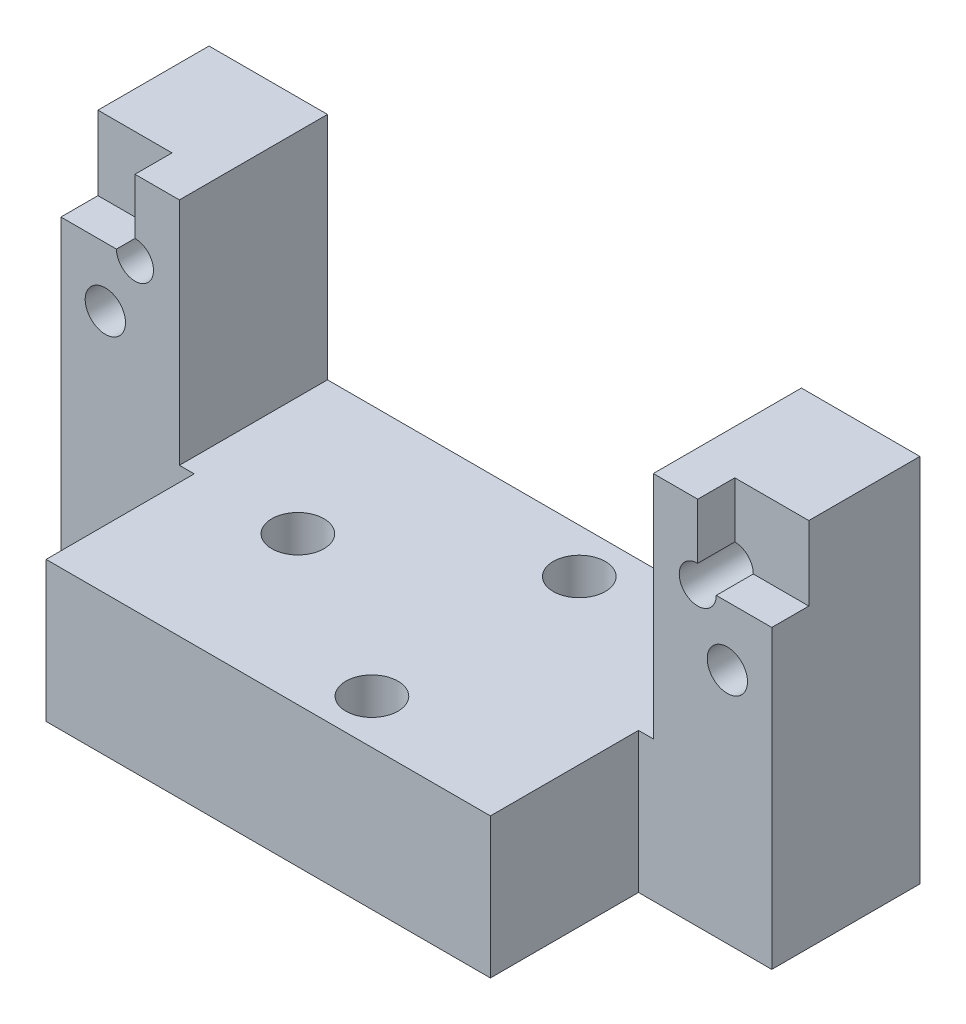
ISO-10303-21;
HEADER;
FILE_DESCRIPTION(('STEP AP214'),'2;1');
FILE_NAME('part.step','',(''),(''),'','','');
FILE_SCHEMA(('AUTOMOTIVE_DESIGN { 1 0 10303 214 1 1 1 1 }'));
ENDSEC;
DATA;
#1=APPLICATION_CONTEXT('core data for automotive mechanical design processes');
#2=APPLICATION_PROTOCOL_DEFINITION('international standard','automotive_design',2000,#1);
#3=PRODUCT_CONTEXT('',#1,'mechanical');
#4=PRODUCT('Part','Part','',(#3));
#5=PRODUCT_RELATED_PRODUCT_CATEGORY('part','',(#4));
#6=PRODUCT_DEFINITION_FORMATION('','',#4);
#7=PRODUCT_DEFINITION_CONTEXT('part definition',#1,'design');
#8=PRODUCT_DEFINITION('design','',#6,#7);
#9=PRODUCT_DEFINITION_SHAPE('','',#8);
#10=(LENGTH_UNIT() NAMED_UNIT(*) SI_UNIT(.MILLI.,.METRE.));
#11=(NAMED_UNIT(*) PLANE_ANGLE_UNIT() SI_UNIT($,.RADIAN.));
#12=(NAMED_UNIT(*) SI_UNIT($,.STERADIAN.) SOLID_ANGLE_UNIT());
#13=UNCERTAINTY_MEASURE_WITH_UNIT(LENGTH_MEASURE(1.E-05),#10,'distance_accuracy_value','');
#14=(GEOMETRIC_REPRESENTATION_CONTEXT(3) GLOBAL_UNCERTAINTY_ASSIGNED_CONTEXT((#13)) GLOBAL_UNIT_ASSIGNED_CONTEXT((#10,
#11,#12)) REPRESENTATION_CONTEXT('',''));
#15=CARTESIAN_POINT('',(0.,0.,0.));
#16=DIRECTION('',(0.,0.,1.));
#17=DIRECTION('',(1.,0.,0.));
#18=AXIS2_PLACEMENT_3D('',#15,#16,#17);
#19=CARTESIAN_POINT('',(0.,0.,0.));
#20=DIRECTION('',(0.,0.,-1.));
#21=DIRECTION('',(1.,0.,0.));
#22=AXIS2_PLACEMENT_3D('',#19,#20,#21);
#23=PLANE('',#22);
#24=CARTESIAN_POINT('',(-26.67,4.445,0.));
#25=DIRECTION('',(0.,0.,1.));
#26=DIRECTION('',(1.,0.,0.));
#27=AXIS2_PLACEMENT_3D('',#24,#25,#26);
#28=CIRCLE('',#27,1.72719999999999);
#29=CARTESIAN_POINT('',(-24.9428,4.445,0.));
#30=VERTEX_POINT('',#29);
#31=EDGE_CURVE('E497',#30,#30,#28,.T.);
#32=ORIENTED_EDGE('',*,*,#31,.F.);
#33=EDGE_LOOP('',(#32));
#34=FACE_BOUND('',#33,.T.);
#35=CARTESIAN_POINT('',(-24.13,9.525,0.));
#36=DIRECTION('',(0.,0.,-1.));
#37=DIRECTION('',(-1.,0.,0.));
#38=AXIS2_PLACEMENT_3D('',#35,#36,#37);
#39=CIRCLE('',#38,1.5875);
#40=CARTESIAN_POINT('',(-24.13,11.1125,0.));
#41=VERTEX_POINT('',#40);
#42=CARTESIAN_POINT('',(-25.7175,9.525,0.));
#43=VERTEX_POINT('',#42);
#44=EDGE_CURVE('E183',#41,#43,#39,.T.);
#45=ORIENTED_EDGE('',*,*,#44,.T.);
#46=DIRECTION('',(-1.,0.,0.));
#47=VECTOR('',#46,1.);
#48=CARTESIAN_POINT('',(-30.48,9.525,0.));
#49=LINE('',#48,#47);
#50=CARTESIAN_POINT('',(-30.48,9.525,0.));
#51=VERTEX_POINT('',#50);
#52=EDGE_CURVE('E68',#43,#51,#49,.T.);
#53=ORIENTED_EDGE('',*,*,#52,.T.);
#54=DIRECTION('',(0.,1.,0.));
#55=VECTOR('',#54,1.);
#56=CARTESIAN_POINT('',(-30.48,15.875,0.));
#57=LINE('',#56,#55);
#58=CARTESIAN_POINT('',(-30.48,-15.875,0.));
#59=VERTEX_POINT('',#58);
#60=EDGE_CURVE('E265',#59,#51,#57,.T.);
#61=ORIENTED_EDGE('',*,*,#60,.F.);
#62=DIRECTION('',(-1.,0.,0.));
#63=VECTOR('',#62,1.);
#64=CARTESIAN_POINT('',(-30.48,-15.875,0.));
#65=LINE('',#64,#63);
#66=CARTESIAN_POINT('',(-19.05,-15.875,0.));
#67=VERTEX_POINT('',#66);
#68=EDGE_CURVE('E267',#67,#59,#65,.T.);
#69=ORIENTED_EDGE('',*,*,#68,.F.);
#70=DIRECTION('',(0.,-1.,0.));
#71=VECTOR('',#70,1.);
#72=CARTESIAN_POINT('',(-19.05,15.875,0.));
#73=LINE('',#72,#71);
#74=CARTESIAN_POINT('',(-19.05,-3.8354,0.));
#75=VERTEX_POINT('',#74);
#76=EDGE_CURVE('E270',#75,#67,#73,.T.);
#77=ORIENTED_EDGE('',*,*,#76,.F.);
#78=DIRECTION('',(1.,0.,0.));
#79=VECTOR('',#78,1.);
#80=CARTESIAN_POINT('',(-20.32,-3.8354,0.));
#81=LINE('',#80,#79);
#82=CARTESIAN_POINT('',(-20.32,-3.8354,0.));
#83=VERTEX_POINT('',#82);
#84=EDGE_CURVE('E349',#83,#75,#81,.T.);
#85=ORIENTED_EDGE('',*,*,#84,.F.);
#86=DIRECTION('',(0.,-1.,0.));
#87=VECTOR('',#86,1.);
#88=CARTESIAN_POINT('',(-20.32,15.875,0.));
#89=LINE('',#88,#87);
#90=CARTESIAN_POINT('',(-20.32,15.875,0.));
#91=VERTEX_POINT('',#90);
#92=EDGE_CURVE('E278',#91,#83,#89,.T.);
#93=ORIENTED_EDGE('',*,*,#92,.F.);
#94=DIRECTION('',(1.,0.,0.));
#95=VECTOR('',#94,1.);
#96=CARTESIAN_POINT('',(-30.48,15.875,0.));
#97=LINE('',#96,#95);
#98=CARTESIAN_POINT('',(-24.13,15.875,0.));
#99=VERTEX_POINT('',#98);
#100=EDGE_CURVE('E272',#99,#91,#97,.T.);
#101=ORIENTED_EDGE('',*,*,#100,.F.);
#102=DIRECTION('',(0.,-1.,0.));
#103=VECTOR('',#102,1.);
#104=CARTESIAN_POINT('',(-24.13,15.875,0.));
#105=LINE('',#104,#103);
#106=EDGE_CURVE('E190',#99,#41,#105,.T.);
#107=ORIENTED_EDGE('',*,*,#106,.T.);
#108=EDGE_LOOP('',(#45,#53,#61,#69,#77,#85,#93,#101,#107));
#109=FACE_BOUND('',#108,.T.);
#110=ADVANCED_FACE('F46',(#34,#109),#23,.F.);
#111=CARTESIAN_POINT('',(-24.13,15.875,-3.175));
#112=DIRECTION('',(-1.,0.,0.));
#113=DIRECTION('',(0.,0.,1.));
#114=AXIS2_PLACEMENT_3D('',#111,#112,#113);
#115=PLANE('',#114);
#116=DIRECTION('',(0.,-1.,0.));
#117=VECTOR('',#116,1.);
#118=CARTESIAN_POINT('',(-24.13,15.875,-3.175));
#119=LINE('',#118,#117);
#120=CARTESIAN_POINT('',(-24.13,15.875,-3.175));
#121=VERTEX_POINT('',#120);
#122=CARTESIAN_POINT('',(-24.13,11.1125,-3.175));
#123=VERTEX_POINT('',#122);
#124=EDGE_CURVE('E485',#121,#123,#119,.T.);
#125=ORIENTED_EDGE('',*,*,#124,.T.);
#126=DIRECTION('',(0.,0.,1.));
#127=VECTOR('',#126,1.);
#128=CARTESIAN_POINT('',(-24.13,11.1125,-6.35));
#129=LINE('',#128,#127);
#130=EDGE_CURVE('E60',#123,#41,#129,.T.);
#131=ORIENTED_EDGE('',*,*,#130,.T.);
#132=ORIENTED_EDGE('',*,*,#106,.F.);
#133=DIRECTION('',(0.,0.,1.));
#134=VECTOR('',#133,1.);
#135=CARTESIAN_POINT('',(-24.13,15.875,-3.175));
#136=LINE('',#135,#134);
#137=EDGE_CURVE('E205',#121,#99,#136,.T.);
#138=ORIENTED_EDGE('',*,*,#137,.F.);
#139=EDGE_LOOP('',(#125,#131,#132,#138));
#140=FACE_BOUND('',#139,.T.);
#141=ADVANCED_FACE('F395',(#140),#115,.T.);
#142=CARTESIAN_POINT('',(-30.48,9.525,-3.175));
#143=DIRECTION('',(0.,1.,0.));
#144=DIRECTION('',(-1.,0.,0.));
#145=AXIS2_PLACEMENT_3D('',#142,#143,#144);
#146=PLANE('',#145);
#147=ORIENTED_EDGE('',*,*,#52,.F.);
#148=DIRECTION('',(0.,0.,1.));
#149=VECTOR('',#148,1.);
#150=CARTESIAN_POINT('',(-25.7175,9.525,-6.35));
#151=LINE('',#150,#149);
#152=CARTESIAN_POINT('',(-25.7175,9.525,-3.175));
#153=VERTEX_POINT('',#152);
#154=EDGE_CURVE('E181',#43,#153,#151,.F.);
#155=ORIENTED_EDGE('',*,*,#154,.T.);
#156=DIRECTION('',(-1.,0.,0.));
#157=VECTOR('',#156,1.);
#158=CARTESIAN_POINT('',(-30.48,9.525,-3.175));
#159=LINE('',#158,#157);
#160=CARTESIAN_POINT('',(-30.48,9.525,-3.175));
#161=VERTEX_POINT('',#160);
#162=EDGE_CURVE('E489',#153,#161,#159,.T.);
#163=ORIENTED_EDGE('',*,*,#162,.T.);
#164=DIRECTION('',(0.,0.,1.));
#165=VECTOR('',#164,1.);
#166=CARTESIAN_POINT('',(-30.48,9.525,-3.175));
#167=LINE('',#166,#165);
#168=EDGE_CURVE('E195',#161,#51,#167,.T.);
#169=ORIENTED_EDGE('',*,*,#168,.T.);
#170=EDGE_LOOP('',(#147,#155,#163,#169));
#171=FACE_BOUND('',#170,.T.);
#172=ADVANCED_FACE('F193',(#171),#146,.T.);
#173=CARTESIAN_POINT('',(0.,0.,-3.175));
#174=DIRECTION('',(0.,0.,-1.));
#175=DIRECTION('',(1.,0.,0.));
#176=AXIS2_PLACEMENT_3D('',#173,#174,#175);
#177=PLANE('',#176);
#178=CARTESIAN_POINT('',(-24.13,9.525,-3.175));
#179=DIRECTION('',(0.,0.,-1.));
#180=DIRECTION('',(-1.,0.,0.));
#181=AXIS2_PLACEMENT_3D('',#178,#179,#180);
#182=CIRCLE('',#181,1.5875);
#183=EDGE_CURVE('E13',#123,#153,#182,.F.);
#184=ORIENTED_EDGE('',*,*,#183,.F.);
#185=ORIENTED_EDGE('',*,*,#124,.F.);
#186=DIRECTION('',(1.,0.,0.));
#187=VECTOR('',#186,1.);
#188=CARTESIAN_POINT('',(-30.48,15.875,-3.175));
#189=LINE('',#188,#187);
#190=CARTESIAN_POINT('',(-30.48,15.875,-3.175));
#191=VERTEX_POINT('',#190);
#192=EDGE_CURVE('E202',#191,#121,#189,.T.);
#193=ORIENTED_EDGE('',*,*,#192,.F.);
#194=DIRECTION('',(0.,1.,0.));
#195=VECTOR('',#194,1.);
#196=CARTESIAN_POINT('',(-30.48,15.875,-3.175));
#197=LINE('',#196,#195);
#198=EDGE_CURVE('E198',#161,#191,#197,.T.);
#199=ORIENTED_EDGE('',*,*,#198,.F.);
#200=ORIENTED_EDGE('',*,*,#162,.F.);
#201=EDGE_LOOP('',(#184,#185,#193,#199,#200));
#202=FACE_BOUND('',#201,.T.);
#203=ADVANCED_FACE('F487',(#202),#177,.F.);
#204=CARTESIAN_POINT('',(-30.48,15.875,12.7));
#205=DIRECTION('',(0.,-1.,0.));
#206=DIRECTION('',(0.,0.,-1.));
#207=AXIS2_PLACEMENT_3D('',#204,#205,#206);
#208=PLANE('',#207);
#209=ORIENTED_EDGE('',*,*,#137,.T.);
#210=ORIENTED_EDGE('',*,*,#100,.T.);
#211=DIRECTION('',(0.,0.,1.));
#212=VECTOR('',#211,1.);
#213=CARTESIAN_POINT('',(-20.32,15.875,-12.701));
#214=LINE('',#213,#212);
#215=CARTESIAN_POINT('',(-20.32,15.875,-12.7));
#216=VERTEX_POINT('',#215);
#217=EDGE_CURVE('E306',#216,#91,#214,.T.);
#218=ORIENTED_EDGE('',*,*,#217,.F.);
#219=DIRECTION('',(-1.,0.,0.));
#220=VECTOR('',#219,1.);
#221=CARTESIAN_POINT('',(-30.48,15.875,-12.7));
#222=LINE('',#221,#220);
#223=CARTESIAN_POINT('',(-30.48,15.875,-12.7));
#224=VERTEX_POINT('',#223);
#225=EDGE_CURVE('E333',#216,#224,#222,.T.);
#226=ORIENTED_EDGE('',*,*,#225,.T.);
#227=DIRECTION('',(0.,0.,-1.));
#228=VECTOR('',#227,1.);
#229=CARTESIAN_POINT('',(-30.48,15.875,12.7));
#230=LINE('',#229,#228);
#231=EDGE_CURVE('E323',#191,#224,#230,.T.);
#232=ORIENTED_EDGE('',*,*,#231,.F.);
#233=ORIENTED_EDGE('',*,*,#192,.T.);
#234=EDGE_LOOP('',(#209,#210,#218,#226,#232,#233));
#235=FACE_BOUND('',#234,.T.);
#236=ADVANCED_FACE('F440',(#235),#208,.F.);
#237=CARTESIAN_POINT('',(-30.48,15.875,12.7));
#238=DIRECTION('',(1.,0.,0.));
#239=DIRECTION('',(0.,0.,-1.));
#240=AXIS2_PLACEMENT_3D('',#237,#238,#239);
#241=PLANE('',#240);
#242=ORIENTED_EDGE('',*,*,#168,.F.);
#243=ORIENTED_EDGE('',*,*,#198,.T.);
#244=ORIENTED_EDGE('',*,*,#231,.T.);
#245=DIRECTION('',(0.,-1.,0.));
#246=VECTOR('',#245,1.);
#247=CARTESIAN_POINT('',(-30.48,15.875,-12.7));
#248=LINE('',#247,#246);
#249=CARTESIAN_POINT('',(-30.48,-15.875,-12.7));
#250=VERTEX_POINT('',#249);
#251=EDGE_CURVE('E320',#224,#250,#248,.T.);
#252=ORIENTED_EDGE('',*,*,#251,.T.);
#253=DIRECTION('',(0.,0.,-1.));
#254=VECTOR('',#253,1.);
#255=CARTESIAN_POINT('',(-30.48,-15.875,12.7));
#256=LINE('',#255,#254);
#257=EDGE_CURVE('E341',#59,#250,#256,.T.);
#258=ORIENTED_EDGE('',*,*,#257,.F.);
#259=ORIENTED_EDGE('',*,*,#60,.T.);
#260=EDGE_LOOP('',(#242,#243,#244,#252,#258,#259));
#261=FACE_BOUND('',#260,.T.);
#262=ADVANCED_FACE('F48',(#261),#241,.F.);
#263=CARTESIAN_POINT('',(0.,0.,0.));
#264=DIRECTION('',(0.,0.,-1.));
#265=DIRECTION('',(-1.,0.,0.));
#266=AXIS2_PLACEMENT_3D('',#263,#264,#265);
#267=PLANE('',#266);
#268=DIRECTION('',(1.,0.,0.));
#269=VECTOR('',#268,1.);
#270=CARTESIAN_POINT('',(30.48,9.525,0.));
#271=LINE('',#270,#269);
#272=CARTESIAN_POINT('',(25.7175,9.525,0.));
#273=VERTEX_POINT('',#272);
#274=CARTESIAN_POINT('',(30.48,9.525,0.));
#275=VERTEX_POINT('',#274);
#276=EDGE_CURVE('E248',#273,#275,#271,.T.);
#277=ORIENTED_EDGE('',*,*,#276,.F.);
#278=CARTESIAN_POINT('',(24.13,9.525,0.));
#279=DIRECTION('',(0.,0.,1.));
#280=DIRECTION('',(1.,0.,0.));
#281=AXIS2_PLACEMENT_3D('',#278,#279,#280);
#282=CIRCLE('',#281,1.5875);
#283=CARTESIAN_POINT('',(24.13,11.1125,0.));
#284=VERTEX_POINT('',#283);
#285=EDGE_CURVE('E233',#284,#273,#282,.T.);
#286=ORIENTED_EDGE('',*,*,#285,.F.);
#287=DIRECTION('',(0.,-1.,0.));
#288=VECTOR('',#287,1.);
#289=CARTESIAN_POINT('',(24.13,15.875,0.));
#290=LINE('',#289,#288);
#291=CARTESIAN_POINT('',(24.13,15.875,0.));
#292=VERTEX_POINT('',#291);
#293=EDGE_CURVE('E244',#292,#284,#290,.T.);
#294=ORIENTED_EDGE('',*,*,#293,.F.);
#295=DIRECTION('',(-1.,0.,0.));
#296=VECTOR('',#295,1.);
#297=CARTESIAN_POINT('',(30.48,15.875,0.));
#298=LINE('',#297,#296);
#299=CARTESIAN_POINT('',(20.32,15.875,0.));
#300=VERTEX_POINT('',#299);
#301=EDGE_CURVE('E285',#292,#300,#298,.T.);
#302=ORIENTED_EDGE('',*,*,#301,.T.);
#303=DIRECTION('',(0.,1.,0.));
#304=VECTOR('',#303,1.);
#305=CARTESIAN_POINT('',(20.32,15.875,0.));
#306=LINE('',#305,#304);
#307=CARTESIAN_POINT('',(20.32,-3.8354,0.));
#308=VERTEX_POINT('',#307);
#309=EDGE_CURVE('E296',#308,#300,#306,.T.);
#310=ORIENTED_EDGE('',*,*,#309,.F.);
#311=DIRECTION('',(1.,0.,0.));
#312=VECTOR('',#311,1.);
#313=CARTESIAN_POINT('',(-20.32,-3.8354,0.));
#314=LINE('',#313,#312);
#315=CARTESIAN_POINT('',(19.05,-3.8354,0.));
#316=VERTEX_POINT('',#315);
#317=EDGE_CURVE('E343',#316,#308,#314,.T.);
#318=ORIENTED_EDGE('',*,*,#317,.F.);
#319=DIRECTION('',(0.,-1.,0.));
#320=VECTOR('',#319,1.);
#321=CARTESIAN_POINT('',(19.05,15.875,0.));
#322=LINE('',#321,#320);
#323=CARTESIAN_POINT('',(19.05,-15.875,0.));
#324=VERTEX_POINT('',#323);
#325=EDGE_CURVE('E287',#316,#324,#322,.T.);
#326=ORIENTED_EDGE('',*,*,#325,.T.);
#327=DIRECTION('',(1.,0.,0.));
#328=VECTOR('',#327,1.);
#329=CARTESIAN_POINT('',(30.48,-15.875,0.));
#330=LINE('',#329,#328);
#331=CARTESIAN_POINT('',(30.48,-15.875,0.));
#332=VERTEX_POINT('',#331);
#333=EDGE_CURVE('E289',#324,#332,#330,.T.);
#334=ORIENTED_EDGE('',*,*,#333,.T.);
#335=DIRECTION('',(0.,1.,0.));
#336=VECTOR('',#335,1.);
#337=CARTESIAN_POINT('',(30.48,15.875,0.));
#338=LINE('',#337,#336);
#339=EDGE_CURVE('E282',#332,#275,#338,.T.);
#340=ORIENTED_EDGE('',*,*,#339,.T.);
#341=EDGE_LOOP('',(#277,#286,#294,#302,#310,#318,#326,#334,#340));
#342=FACE_BOUND('',#341,.T.);
#343=CARTESIAN_POINT('',(26.67,4.445,0.));
#344=DIRECTION('',(0.,0.,1.));
#345=DIRECTION('',(1.,0.,0.));
#346=AXIS2_PLACEMENT_3D('',#343,#344,#345);
#347=CIRCLE('',#346,1.72719999999999);
#348=CARTESIAN_POINT('',(28.3972,4.445,0.));
#349=VERTEX_POINT('',#348);
#350=EDGE_CURVE('E227',#349,#349,#347,.T.);
#351=ORIENTED_EDGE('',*,*,#350,.F.);
#352=EDGE_LOOP('',(#351));
#353=FACE_BOUND('',#352,.T.);
#354=ADVANCED_FACE('F378',(#342,#353),#267,.F.);
#355=CARTESIAN_POINT('',(-30.48,-15.875,12.7));
#356=DIRECTION('',(0.,1.,0.));
#357=DIRECTION('',(0.,0.,1.));
#358=AXIS2_PLACEMENT_3D('',#355,#356,#357);
#359=PLANE('',#358);
#360=CARTESIAN_POINT('',(-10.16,-15.875,0.));
#361=DIRECTION('',(0.,1.,0.));
#362=DIRECTION('',(0.,0.,1.));
#363=AXIS2_PLACEMENT_3D('',#360,#361,#362);
#364=CIRCLE('',#363,2.2352);
#365=CARTESIAN_POINT('',(-10.16,-15.875,2.2352));
#366=VERTEX_POINT('',#365);
#367=EDGE_CURVE('E212',#366,#366,#364,.F.);
#368=ORIENTED_EDGE('',*,*,#367,.F.);
#369=EDGE_LOOP('',(#368));
#370=FACE_BOUND('',#369,.T.);
#371=CARTESIAN_POINT('',(5.08,-15.875,8.89));
#372=DIRECTION('',(0.,1.,0.));
#373=DIRECTION('',(0.,0.,1.));
#374=AXIS2_PLACEMENT_3D('',#371,#372,#373);
#375=CIRCLE('',#374,2.2352);
#376=CARTESIAN_POINT('',(5.08,-15.875,11.1252));
#377=VERTEX_POINT('',#376);
#378=EDGE_CURVE('E218',#377,#377,#375,.F.);
#379=ORIENTED_EDGE('',*,*,#378,.F.);
#380=EDGE_LOOP('',(#379));
#381=FACE_BOUND('',#380,.T.);
#382=CARTESIAN_POINT('',(5.08,-15.875,-8.89));
#383=DIRECTION('',(0.,1.,0.));
#384=DIRECTION('',(0.,0.,1.));
#385=AXIS2_PLACEMENT_3D('',#382,#383,#384);
#386=CIRCLE('',#385,2.2352);
#387=CARTESIAN_POINT('',(5.08,-15.875,-6.6548));
#388=VERTEX_POINT('',#387);
#389=EDGE_CURVE('E224',#388,#388,#386,.F.);
#390=ORIENTED_EDGE('',*,*,#389,.F.);
#391=EDGE_LOOP('',(#390));
#392=FACE_BOUND('',#391,.T.);
#393=DIRECTION('',(0.,0.,1.));
#394=VECTOR('',#393,1.);
#395=CARTESIAN_POINT('',(-19.05,-15.875,0.));
#396=LINE('',#395,#394);
#397=CARTESIAN_POINT('',(-19.05,-15.875,12.7));
#398=VERTEX_POINT('',#397);
#399=EDGE_CURVE('E274',#67,#398,#396,.T.);
#400=ORIENTED_EDGE('',*,*,#399,.F.);
#401=ORIENTED_EDGE('',*,*,#68,.T.);
#402=ORIENTED_EDGE('',*,*,#257,.T.);
#403=DIRECTION('',(1.,0.,0.));
#404=VECTOR('',#403,1.);
#405=CARTESIAN_POINT('',(-30.48,-15.875,-12.7));
#406=LINE('',#405,#404);
#407=CARTESIAN_POINT('',(30.48,-15.875,-12.7));
#408=VERTEX_POINT('',#407);
#409=EDGE_CURVE('E327',#250,#408,#406,.T.);
#410=ORIENTED_EDGE('',*,*,#409,.T.);
#411=DIRECTION('',(0.,0.,-1.));
#412=VECTOR('',#411,1.);
#413=CARTESIAN_POINT('',(30.48,-15.875,12.7));
#414=LINE('',#413,#412);
#415=EDGE_CURVE('E339',#332,#408,#414,.T.);
#416=ORIENTED_EDGE('',*,*,#415,.F.);
#417=ORIENTED_EDGE('',*,*,#333,.F.);
#418=DIRECTION('',(0.,0.,1.));
#419=VECTOR('',#418,1.);
#420=CARTESIAN_POINT('',(19.05,-15.875,0.));
#421=LINE('',#420,#419);
#422=CARTESIAN_POINT('',(19.05,-15.875,12.7));
#423=VERTEX_POINT('',#422);
#424=EDGE_CURVE('E291',#324,#423,#421,.T.);
#425=ORIENTED_EDGE('',*,*,#424,.T.);
#426=DIRECTION('',(1.,0.,0.));
#427=VECTOR('',#426,1.);
#428=CARTESIAN_POINT('',(-30.48,-15.875,12.7));
#429=LINE('',#428,#427);
#430=EDGE_CURVE('E321',#398,#423,#429,.T.);
#431=ORIENTED_EDGE('',*,*,#430,.F.);
#432=EDGE_LOOP('',(#400,#401,#402,#410,#416,#417,#425,#431));
#433=FACE_BOUND('',#432,.T.);
#434=ADVANCED_FACE('F414',(#370,#381,#392,#433),#359,.F.);
#435=CARTESIAN_POINT('',(0.,0.,12.7));
#436=DIRECTION('',(0.,0.,1.));
#437=DIRECTION('',(1.,0.,0.));
#438=AXIS2_PLACEMENT_3D('',#435,#436,#437);
#439=PLANE('',#438);
#440=DIRECTION('',(1.,0.,0.));
#441=VECTOR('',#440,1.);
#442=CARTESIAN_POINT('',(-20.32,-3.8354,12.7));
#443=LINE('',#442,#441);
#444=CARTESIAN_POINT('',(-19.05,-3.8354,12.7));
#445=VERTEX_POINT('',#444);
#446=CARTESIAN_POINT('',(19.05,-3.8354,12.7));
#447=VERTEX_POINT('',#446);
#448=EDGE_CURVE('E303',#445,#447,#443,.T.);
#449=ORIENTED_EDGE('',*,*,#448,.F.);
#450=DIRECTION('',(0.,-1.,0.));
#451=VECTOR('',#450,1.);
#452=CARTESIAN_POINT('',(-19.05,15.875,12.7));
#453=LINE('',#452,#451);
#454=EDGE_CURVE('E263',#445,#398,#453,.T.);
#455=ORIENTED_EDGE('',*,*,#454,.T.);
#456=ORIENTED_EDGE('',*,*,#430,.T.);
#457=DIRECTION('',(0.,-1.,0.));
#458=VECTOR('',#457,1.);
#459=CARTESIAN_POINT('',(19.05,15.875,12.7));
#460=LINE('',#459,#458);
#461=EDGE_CURVE('E281',#447,#423,#460,.T.);
#462=ORIENTED_EDGE('',*,*,#461,.F.);
#463=EDGE_LOOP('',(#449,#455,#456,#462));
#464=FACE_BOUND('',#463,.T.);
#465=ADVANCED_FACE('F426',(#464),#439,.T.);
#466=CARTESIAN_POINT('',(-20.32,-3.8354,-12.701));
#467=DIRECTION('',(0.,-1.,0.));
#468=DIRECTION('',(0.,0.,-1.));
#469=AXIS2_PLACEMENT_3D('',#466,#467,#468);
#470=PLANE('',#469);
#471=CARTESIAN_POINT('',(-10.16,-3.8354,0.));
#472=DIRECTION('',(0.,1.,0.));
#473=DIRECTION('',(0.,0.,1.));
#474=AXIS2_PLACEMENT_3D('',#471,#472,#473);
#475=CIRCLE('',#474,2.2352);
#476=CARTESIAN_POINT('',(-10.16,-3.8354,2.2352));
#477=VERTEX_POINT('',#476);
#478=EDGE_CURVE('E208',#477,#477,#475,.T.);
#479=ORIENTED_EDGE('',*,*,#478,.F.);
#480=EDGE_LOOP('',(#479));
#481=FACE_BOUND('',#480,.T.);
#482=CARTESIAN_POINT('',(5.08,-3.8354,8.89));
#483=DIRECTION('',(0.,1.,0.));
#484=DIRECTION('',(0.,0.,1.));
#485=AXIS2_PLACEMENT_3D('',#482,#483,#484);
#486=CIRCLE('',#485,2.2352);
#487=CARTESIAN_POINT('',(5.08,-3.8354,11.1252));
#488=VERTEX_POINT('',#487);
#489=EDGE_CURVE('E215',#488,#488,#486,.T.);
#490=ORIENTED_EDGE('',*,*,#489,.F.);
#491=EDGE_LOOP('',(#490));
#492=FACE_BOUND('',#491,.T.);
#493=CARTESIAN_POINT('',(5.08,-3.8354,-8.89));
#494=DIRECTION('',(0.,1.,0.));
#495=DIRECTION('',(0.,0.,1.));
#496=AXIS2_PLACEMENT_3D('',#493,#494,#495);
#497=CIRCLE('',#496,2.2352);
#498=CARTESIAN_POINT('',(5.08,-3.8354,-6.6548));
#499=VERTEX_POINT('',#498);
#500=EDGE_CURVE('E221',#499,#499,#497,.T.);
#501=ORIENTED_EDGE('',*,*,#500,.F.);
#502=EDGE_LOOP('',(#501));
#503=FACE_BOUND('',#502,.T.);
#504=DIRECTION('',(0.,0.,-1.));
#505=VECTOR('',#504,1.);
#506=CARTESIAN_POINT('',(-19.05,-3.8354,-12.701));
#507=LINE('',#506,#505);
#508=EDGE_CURVE('E352',#445,#75,#507,.T.);
#509=ORIENTED_EDGE('',*,*,#508,.F.);
#510=ORIENTED_EDGE('',*,*,#448,.T.);
#511=DIRECTION('',(0.,0.,-1.));
#512=VECTOR('',#511,1.);
#513=CARTESIAN_POINT('',(19.05,-3.8354,-12.701));
#514=LINE('',#513,#512);
#515=EDGE_CURVE('E346',#447,#316,#514,.T.);
#516=ORIENTED_EDGE('',*,*,#515,.T.);
#517=ORIENTED_EDGE('',*,*,#317,.T.);
#518=DIRECTION('',(0.,0.,1.));
#519=VECTOR('',#518,1.);
#520=CARTESIAN_POINT('',(20.32,-3.8354,-12.701));
#521=LINE('',#520,#519);
#522=CARTESIAN_POINT('',(20.32,-3.8354,-12.7));
#523=VERTEX_POINT('',#522);
#524=EDGE_CURVE('E313',#523,#308,#521,.T.);
#525=ORIENTED_EDGE('',*,*,#524,.F.);
#526=DIRECTION('',(-1.,0.,0.));
#527=VECTOR('',#526,1.);
#528=CARTESIAN_POINT('',(-20.32,-3.8354,-12.7));
#529=LINE('',#528,#527);
#530=CARTESIAN_POINT('',(-20.32,-3.8354,-12.7));
#531=VERTEX_POINT('',#530);
#532=EDGE_CURVE('E309',#523,#531,#529,.T.);
#533=ORIENTED_EDGE('',*,*,#532,.T.);
#534=DIRECTION('',(0.,0.,1.));
#535=VECTOR('',#534,1.);
#536=CARTESIAN_POINT('',(-20.32,-3.8354,-12.701));
#537=LINE('',#536,#535);
#538=EDGE_CURVE('E305',#531,#83,#537,.T.);
#539=ORIENTED_EDGE('',*,*,#538,.T.);
#540=ORIENTED_EDGE('',*,*,#84,.T.);
#541=EDGE_LOOP('',(#509,#510,#516,#517,#525,#533,#539,#540));
#542=FACE_BOUND('',#541,.T.);
#543=ADVANCED_FACE('F423',(#481,#492,#503,#542),#470,.F.);
#544=CARTESIAN_POINT('',(30.48,15.875,12.7));
#545=DIRECTION('',(-1.,0.,0.));
#546=DIRECTION('',(0.,-1.,0.));
#547=AXIS2_PLACEMENT_3D('',#544,#545,#546);
#548=PLANE('',#547);
#549=DIRECTION('',(0.,1.,0.));
#550=VECTOR('',#549,1.);
#551=CARTESIAN_POINT('',(30.48,15.875,-3.175));
#552=LINE('',#551,#550);
#553=CARTESIAN_POINT('',(30.48,9.525,-3.175));
#554=VERTEX_POINT('',#553);
#555=CARTESIAN_POINT('',(30.48,15.875,-3.175));
#556=VERTEX_POINT('',#555);
#557=EDGE_CURVE('E245',#554,#556,#552,.T.);
#558=ORIENTED_EDGE('',*,*,#557,.F.);
#559=DIRECTION('',(0.,0.,1.));
#560=VECTOR('',#559,1.);
#561=CARTESIAN_POINT('',(30.48,9.525,-3.175));
#562=LINE('',#561,#560);
#563=EDGE_CURVE('E260',#554,#275,#562,.T.);
#564=ORIENTED_EDGE('',*,*,#563,.T.);
#565=ORIENTED_EDGE('',*,*,#339,.F.);
#566=ORIENTED_EDGE('',*,*,#415,.T.);
#567=DIRECTION('',(0.,1.,0.));
#568=VECTOR('',#567,1.);
#569=CARTESIAN_POINT('',(30.48,15.875,-12.7));
#570=LINE('',#569,#568);
#571=CARTESIAN_POINT('',(30.48,15.875,-12.7));
#572=VERTEX_POINT('',#571);
#573=EDGE_CURVE('E330',#408,#572,#570,.T.);
#574=ORIENTED_EDGE('',*,*,#573,.T.);
#575=DIRECTION('',(0.,0.,-1.));
#576=VECTOR('',#575,1.);
#577=CARTESIAN_POINT('',(30.48,15.875,12.7));
#578=LINE('',#577,#576);
#579=EDGE_CURVE('E337',#556,#572,#578,.T.);
#580=ORIENTED_EDGE('',*,*,#579,.F.);
#581=EDGE_LOOP('',(#558,#564,#565,#566,#574,#580));
#582=FACE_BOUND('',#581,.T.);
#583=ADVANCED_FACE('F367',(#582),#548,.F.);
#584=ORIENTED_EDGE('',*,*,#301,.F.);
#585=DIRECTION('',(0.,0.,1.));
#586=VECTOR('',#585,1.);
#587=CARTESIAN_POINT('',(24.13,15.875,-3.175));
#588=LINE('',#587,#586);
#589=CARTESIAN_POINT('',(24.13,15.875,-3.175));
#590=VERTEX_POINT('',#589);
#591=EDGE_CURVE('E256',#590,#292,#588,.T.);
#592=ORIENTED_EDGE('',*,*,#591,.F.);
#593=DIRECTION('',(-1.,0.,0.));
#594=VECTOR('',#593,1.);
#595=CARTESIAN_POINT('',(30.48,15.875,-3.175));
#596=LINE('',#595,#594);
#597=EDGE_CURVE('E247',#556,#590,#596,.T.);
#598=ORIENTED_EDGE('',*,*,#597,.F.);
#599=ORIENTED_EDGE('',*,*,#579,.T.);
#600=CARTESIAN_POINT('',(20.32,15.875,-12.7));
#601=VERTEX_POINT('',#600);
#602=EDGE_CURVE('E324',#572,#601,#222,.T.);
#603=ORIENTED_EDGE('',*,*,#602,.T.);
#604=DIRECTION('',(0.,0.,1.));
#605=VECTOR('',#604,1.);
#606=CARTESIAN_POINT('',(20.32,15.875,-12.701));
#607=LINE('',#606,#605);
#608=EDGE_CURVE('E310',#601,#300,#607,.T.);
#609=ORIENTED_EDGE('',*,*,#608,.T.);
#610=EDGE_LOOP('',(#584,#592,#598,#599,#603,#609));
#611=FACE_BOUND('',#610,.T.);
#612=ADVANCED_FACE('F372',(#611),#208,.F.);
#613=CARTESIAN_POINT('',(0.,0.,-12.7));
#614=DIRECTION('',(0.,0.,1.));
#615=DIRECTION('',(1.,0.,0.));
#616=AXIS2_PLACEMENT_3D('',#613,#614,#615);
#617=PLANE('',#616);
#618=CARTESIAN_POINT('',(-26.67,4.445,-12.7));
#619=DIRECTION('',(0.,0.,1.));
#620=DIRECTION('',(1.,0.,0.));
#621=AXIS2_PLACEMENT_3D('',#618,#619,#620);
#622=CIRCLE('',#621,1.72719999999999);
#623=CARTESIAN_POINT('',(-24.9428,4.445,-12.7));
#624=VERTEX_POINT('',#623);
#625=EDGE_CURVE('E191',#624,#624,#622,.T.);
#626=ORIENTED_EDGE('',*,*,#625,.T.);
#627=EDGE_LOOP('',(#626));
#628=FACE_BOUND('',#627,.T.);
#629=CARTESIAN_POINT('',(26.67,4.445,-12.7));
#630=DIRECTION('',(0.,0.,1.));
#631=DIRECTION('',(1.,0.,0.));
#632=AXIS2_PLACEMENT_3D('',#629,#630,#631);
#633=CIRCLE('',#632,1.72719999999999);
#634=CARTESIAN_POINT('',(28.3972,4.445,-12.7));
#635=VERTEX_POINT('',#634);
#636=EDGE_CURVE('E230',#635,#635,#633,.T.);
#637=ORIENTED_EDGE('',*,*,#636,.T.);
#638=EDGE_LOOP('',(#637));
#639=FACE_BOUND('',#638,.T.);
#640=ORIENTED_EDGE('',*,*,#225,.F.);
#641=DIRECTION('',(0.,1.,0.));
#642=VECTOR('',#641,1.);
#643=CARTESIAN_POINT('',(-20.32,15.875,-12.7));
#644=LINE('',#643,#642);
#645=EDGE_CURVE('E301',#531,#216,#644,.T.);
#646=ORIENTED_EDGE('',*,*,#645,.F.);
#647=ORIENTED_EDGE('',*,*,#532,.F.);
#648=DIRECTION('',(0.,-1.,0.));
#649=VECTOR('',#648,1.);
#650=CARTESIAN_POINT('',(20.32,15.875,-12.7));
#651=LINE('',#650,#649);
#652=EDGE_CURVE('E299',#601,#523,#651,.T.);
#653=ORIENTED_EDGE('',*,*,#652,.F.);
#654=ORIENTED_EDGE('',*,*,#602,.F.);
#655=ORIENTED_EDGE('',*,*,#573,.F.);
#656=ORIENTED_EDGE('',*,*,#409,.F.);
#657=ORIENTED_EDGE('',*,*,#251,.F.);
#658=EDGE_LOOP('',(#640,#646,#647,#653,#654,#655,#656,#657));
#659=FACE_BOUND('',#658,.T.);
#660=ADVANCED_FACE('F430',(#628,#639,#659),#617,.F.);
#661=CARTESIAN_POINT('',(-20.32,15.875,-12.701));
#662=DIRECTION('',(-1.,0.,0.));
#663=DIRECTION('',(0.,0.,1.));
#664=AXIS2_PLACEMENT_3D('',#661,#662,#663);
#665=PLANE('',#664);
#666=ORIENTED_EDGE('',*,*,#217,.T.);
#667=ORIENTED_EDGE('',*,*,#92,.T.);
#668=ORIENTED_EDGE('',*,*,#538,.F.);
#669=ORIENTED_EDGE('',*,*,#645,.T.);
#670=EDGE_LOOP('',(#666,#667,#668,#669));
#671=FACE_BOUND('',#670,.T.);
#672=ADVANCED_FACE('F421',(#671),#665,.F.);
#673=CARTESIAN_POINT('',(20.32,15.875,-12.701));
#674=DIRECTION('',(1.,0.,0.));
#675=DIRECTION('',(0.,0.,-1.));
#676=AXIS2_PLACEMENT_3D('',#673,#674,#675);
#677=PLANE('',#676);
#678=ORIENTED_EDGE('',*,*,#524,.T.);
#679=ORIENTED_EDGE('',*,*,#309,.T.);
#680=ORIENTED_EDGE('',*,*,#608,.F.);
#681=ORIENTED_EDGE('',*,*,#652,.T.);
#682=EDGE_LOOP('',(#678,#679,#680,#681));
#683=FACE_BOUND('',#682,.T.);
#684=ADVANCED_FACE('F417',(#683),#677,.F.);
#685=CARTESIAN_POINT('',(19.05,15.875,0.));
#686=DIRECTION('',(-1.,0.,0.));
#687=DIRECTION('',(0.,-1.,0.));
#688=AXIS2_PLACEMENT_3D('',#685,#686,#687);
#689=PLANE('',#688);
#690=ORIENTED_EDGE('',*,*,#461,.T.);
#691=ORIENTED_EDGE('',*,*,#424,.F.);
#692=ORIENTED_EDGE('',*,*,#325,.F.);
#693=ORIENTED_EDGE('',*,*,#515,.F.);
#694=EDGE_LOOP('',(#690,#691,#692,#693));
#695=FACE_BOUND('',#694,.T.);
#696=ADVANCED_FACE('F410',(#695),#689,.F.);
#697=CARTESIAN_POINT('',(-19.05,15.875,0.));
#698=DIRECTION('',(-1.,0.,0.));
#699=DIRECTION('',(0.,-1.,0.));
#700=AXIS2_PLACEMENT_3D('',#697,#698,#699);
#701=PLANE('',#700);
#702=ORIENTED_EDGE('',*,*,#508,.T.);
#703=ORIENTED_EDGE('',*,*,#76,.T.);
#704=ORIENTED_EDGE('',*,*,#399,.T.);
#705=ORIENTED_EDGE('',*,*,#454,.F.);
#706=EDGE_LOOP('',(#702,#703,#704,#705));
#707=FACE_BOUND('',#706,.T.);
#708=ADVANCED_FACE('F407',(#707),#701,.T.);
#709=CARTESIAN_POINT('',(30.48,9.525,-3.175));
#710=DIRECTION('',(0.,-1.,0.));
#711=DIRECTION('',(1.,0.,0.));
#712=AXIS2_PLACEMENT_3D('',#709,#710,#711);
#713=PLANE('',#712);
#714=DIRECTION('',(1.,0.,0.));
#715=VECTOR('',#714,1.);
#716=CARTESIAN_POINT('',(30.48,9.525,-3.175));
#717=LINE('',#716,#715);
#718=CARTESIAN_POINT('',(25.7175,9.525,-3.175));
#719=VERTEX_POINT('',#718);
#720=EDGE_CURVE('E254',#719,#554,#717,.T.);
#721=ORIENTED_EDGE('',*,*,#720,.F.);
#722=DIRECTION('',(0.,0.,1.));
#723=VECTOR('',#722,1.);
#724=CARTESIAN_POINT('',(25.7175,9.525,-6.35));
#725=LINE('',#724,#723);
#726=EDGE_CURVE('E241',#719,#273,#725,.T.);
#727=ORIENTED_EDGE('',*,*,#726,.T.);
#728=ORIENTED_EDGE('',*,*,#276,.T.);
#729=ORIENTED_EDGE('',*,*,#563,.F.);
#730=EDGE_LOOP('',(#721,#727,#728,#729));
#731=FACE_BOUND('',#730,.T.);
#732=ADVANCED_FACE('F361',(#731),#713,.F.);
#733=CARTESIAN_POINT('',(24.13,15.875,-3.175));
#734=DIRECTION('',(-1.,0.,0.));
#735=DIRECTION('',(0.,0.,1.));
#736=AXIS2_PLACEMENT_3D('',#733,#734,#735);
#737=PLANE('',#736);
#738=ORIENTED_EDGE('',*,*,#293,.T.);
#739=DIRECTION('',(0.,0.,1.));
#740=VECTOR('',#739,1.);
#741=CARTESIAN_POINT('',(24.13,11.1125,-6.35));
#742=LINE('',#741,#740);
#743=CARTESIAN_POINT('',(24.13,11.1125,-3.175));
#744=VERTEX_POINT('',#743);
#745=EDGE_CURVE('E237',#284,#744,#742,.F.);
#746=ORIENTED_EDGE('',*,*,#745,.T.);
#747=DIRECTION('',(0.,-1.,0.));
#748=VECTOR('',#747,1.);
#749=CARTESIAN_POINT('',(24.13,15.875,-3.175));
#750=LINE('',#749,#748);
#751=EDGE_CURVE('E251',#590,#744,#750,.T.);
#752=ORIENTED_EDGE('',*,*,#751,.F.);
#753=ORIENTED_EDGE('',*,*,#591,.T.);
#754=EDGE_LOOP('',(#738,#746,#752,#753));
#755=FACE_BOUND('',#754,.T.);
#756=ADVANCED_FACE('F375',(#755),#737,.F.);
#757=CARTESIAN_POINT('',(0.,0.,-3.175));
#758=DIRECTION('',(0.,0.,-1.));
#759=DIRECTION('',(-1.,0.,0.));
#760=AXIS2_PLACEMENT_3D('',#757,#758,#759);
#761=PLANE('',#760);
#762=ORIENTED_EDGE('',*,*,#751,.T.);
#763=CARTESIAN_POINT('',(24.13,9.525,-3.175));
#764=DIRECTION('',(0.,0.,-1.));
#765=DIRECTION('',(-1.,0.,0.));
#766=AXIS2_PLACEMENT_3D('',#763,#764,#765);
#767=CIRCLE('',#766,1.5875);
#768=EDGE_CURVE('E54',#744,#719,#767,.T.);
#769=ORIENTED_EDGE('',*,*,#768,.T.);
#770=ORIENTED_EDGE('',*,*,#720,.T.);
#771=ORIENTED_EDGE('',*,*,#557,.T.);
#772=ORIENTED_EDGE('',*,*,#597,.T.);
#773=EDGE_LOOP('',(#762,#769,#770,#771,#772));
#774=FACE_BOUND('',#773,.T.);
#775=ADVANCED_FACE('F357',(#774),#761,.F.);
#776=CARTESIAN_POINT('',(24.13,9.525,-6.35));
#777=DIRECTION('',(0.,0.,1.));
#778=DIRECTION('',(1.,0.,0.));
#779=AXIS2_PLACEMENT_3D('',#776,#777,#778);
#780=CYLINDRICAL_SURFACE('',#779,1.5875);
#781=CARTESIAN_POINT('',(24.13,9.525,-6.35));
#782=DIRECTION('',(0.,0.,1.));
#783=DIRECTION('',(1.,0.,0.));
#784=AXIS2_PLACEMENT_3D('',#781,#782,#783);
#785=CIRCLE('',#784,1.5875);
#786=CARTESIAN_POINT('',(25.7175,9.525,-6.35));
#787=VERTEX_POINT('',#786);
#788=EDGE_CURVE('E234',#787,#787,#785,.T.);
#789=ORIENTED_EDGE('',*,*,#788,.F.);
#790=EDGE_LOOP('',(#789));
#791=FACE_BOUND('',#790,.T.);
#792=ORIENTED_EDGE('',*,*,#768,.F.);
#793=ORIENTED_EDGE('',*,*,#745,.F.);
#794=ORIENTED_EDGE('',*,*,#285,.T.);
#795=ORIENTED_EDGE('',*,*,#726,.F.);
#796=EDGE_LOOP('',(#792,#793,#794,#795));
#797=FACE_BOUND('',#796,.T.);
#798=ADVANCED_FACE('F380',(#791,#797),#780,.F.);
#799=CARTESIAN_POINT('',(24.13,9.525,-6.35));
#800=DIRECTION('',(0.,0.,1.));
#801=DIRECTION('',(1.,0.,0.));
#802=AXIS2_PLACEMENT_3D('',#799,#800,#801);
#803=PLANE('',#802);
#804=ORIENTED_EDGE('',*,*,#788,.T.);
#805=EDGE_LOOP('',(#804));
#806=FACE_BOUND('',#805,.T.);
#807=ADVANCED_FACE('F382',(#806),#803,.T.);
#808=CARTESIAN_POINT('',(26.67,4.445,0.));
#809=DIRECTION('',(0.,0.,1.));
#810=DIRECTION('',(1.,0.,0.));
#811=AXIS2_PLACEMENT_3D('',#808,#809,#810);
#812=CYLINDRICAL_SURFACE('',#811,1.72719999999999);
#813=ORIENTED_EDGE('',*,*,#636,.F.);
#814=EDGE_LOOP('',(#813));
#815=FACE_BOUND('',#814,.T.);
#816=ORIENTED_EDGE('',*,*,#350,.T.);
#817=EDGE_LOOP('',(#816));
#818=FACE_BOUND('',#817,.T.);
#819=ADVANCED_FACE('F389',(#815,#818),#812,.F.);
#820=CARTESIAN_POINT('',(5.08,-15.876,-8.89));
#821=DIRECTION('',(0.,1.,0.));
#822=DIRECTION('',(0.,0.,1.));
#823=AXIS2_PLACEMENT_3D('',#820,#821,#822);
#824=CYLINDRICAL_SURFACE('',#823,2.2352);
#825=ORIENTED_EDGE('',*,*,#500,.T.);
#826=EDGE_LOOP('',(#825));
#827=FACE_BOUND('',#826,.T.);
#828=ORIENTED_EDGE('',*,*,#389,.T.);
#829=EDGE_LOOP('',(#828));
#830=FACE_BOUND('',#829,.T.);
#831=ADVANCED_FACE('F526',(#827,#830),#824,.F.);
#832=CARTESIAN_POINT('',(5.08,-15.876,8.89));
#833=DIRECTION('',(0.,1.,0.));
#834=DIRECTION('',(0.,0.,1.));
#835=AXIS2_PLACEMENT_3D('',#832,#833,#834);
#836=CYLINDRICAL_SURFACE('',#835,2.2352);
#837=ORIENTED_EDGE('',*,*,#489,.T.);
#838=EDGE_LOOP('',(#837));
#839=FACE_BOUND('',#838,.T.);
#840=ORIENTED_EDGE('',*,*,#378,.T.);
#841=EDGE_LOOP('',(#840));
#842=FACE_BOUND('',#841,.T.);
#843=ADVANCED_FACE('F522',(#839,#842),#836,.F.);
#844=CARTESIAN_POINT('',(-10.16,-15.876,0.));
#845=DIRECTION('',(0.,1.,0.));
#846=DIRECTION('',(0.,0.,1.));
#847=AXIS2_PLACEMENT_3D('',#844,#845,#846);
#848=CYLINDRICAL_SURFACE('',#847,2.2352);
#849=ORIENTED_EDGE('',*,*,#478,.T.);
#850=EDGE_LOOP('',(#849));
#851=FACE_BOUND('',#850,.T.);
#852=ORIENTED_EDGE('',*,*,#367,.T.);
#853=EDGE_LOOP('',(#852));
#854=FACE_BOUND('',#853,.T.);
#855=ADVANCED_FACE('F514',(#851,#854),#848,.F.);
#856=CARTESIAN_POINT('',(-24.13,9.525,-6.35));
#857=DIRECTION('',(0.,0.,1.));
#858=DIRECTION('',(1.,0.,0.));
#859=AXIS2_PLACEMENT_3D('',#856,#857,#858);
#860=CYLINDRICAL_SURFACE('',#859,1.5875);
#861=CARTESIAN_POINT('',(-24.13,9.525,-6.35));
#862=DIRECTION('',(0.,0.,-1.));
#863=DIRECTION('',(-1.,0.,0.));
#864=AXIS2_PLACEMENT_3D('',#861,#862,#863);
#865=CIRCLE('',#864,1.5875);
#866=CARTESIAN_POINT('',(-25.7175,9.525,-6.35));
#867=VERTEX_POINT('',#866);
#868=EDGE_CURVE('E186',#867,#867,#865,.T.);
#869=ORIENTED_EDGE('',*,*,#868,.T.);
#870=EDGE_LOOP('',(#869));
#871=FACE_BOUND('',#870,.T.);
#872=ORIENTED_EDGE('',*,*,#183,.T.);
#873=ORIENTED_EDGE('',*,*,#154,.F.);
#874=ORIENTED_EDGE('',*,*,#44,.F.);
#875=ORIENTED_EDGE('',*,*,#130,.F.);
#876=EDGE_LOOP('',(#872,#873,#874,#875));
#877=FACE_BOUND('',#876,.T.);
#878=ADVANCED_FACE('F182',(#871,#877),#860,.F.);
#879=CARTESIAN_POINT('',(-24.13,9.525,-6.35));
#880=DIRECTION('',(0.,0.,1.));
#881=DIRECTION('',(-1.,0.,0.));
#882=AXIS2_PLACEMENT_3D('',#879,#880,#881);
#883=PLANE('',#882);
#884=ORIENTED_EDGE('',*,*,#868,.F.);
#885=EDGE_LOOP('',(#884));
#886=FACE_BOUND('',#885,.T.);
#887=ADVANCED_FACE('F502',(#886),#883,.T.);
#888=CARTESIAN_POINT('',(-26.67,4.445,0.));
#889=DIRECTION('',(0.,0.,1.));
#890=DIRECTION('',(1.,0.,0.));
#891=AXIS2_PLACEMENT_3D('',#888,#889,#890);
#892=CYLINDRICAL_SURFACE('',#891,1.72719999999999);
#893=ORIENTED_EDGE('',*,*,#625,.F.);
#894=EDGE_LOOP('',(#893));
#895=FACE_BOUND('',#894,.T.);
#896=ORIENTED_EDGE('',*,*,#31,.T.);
#897=EDGE_LOOP('',(#896));
#898=FACE_BOUND('',#897,.T.);
#899=ADVANCED_FACE('F500',(#895,#898),#892,.F.);
#900=CLOSED_SHELL('',(#110,#141,#172,#203,#236,#262,#354,#434,#465,#543,#583,#612,#660,#672,
#684,#696,#708,#732,#756,#775,#798,#807,#819,#831,#843,#855,#878,#887,#899));
#901=MANIFOLD_SOLID_BREP('B2',#900);
#902=ADVANCED_BREP_SHAPE_REPRESENTATION('',(#18,#901),#14);
#903=SHAPE_DEFINITION_REPRESENTATION(#9,#902);
ENDSEC;
END-ISO-10303-21;
